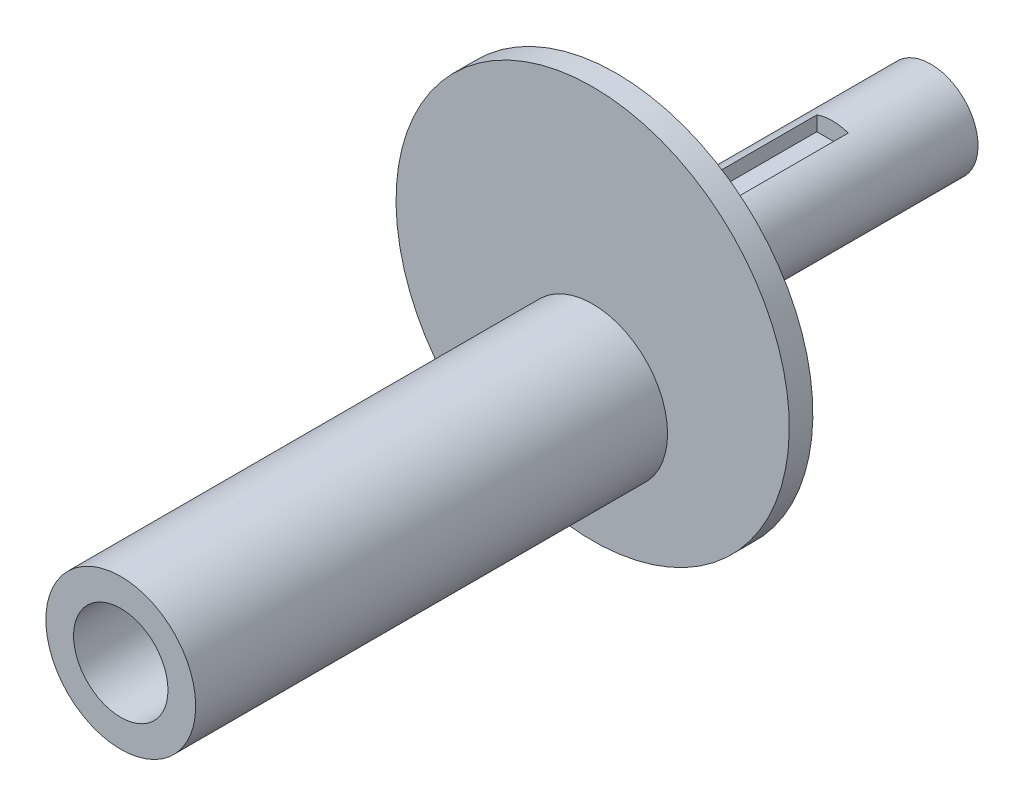
ISO-10303-21;
HEADER;
FILE_DESCRIPTION(('STEP AP214'),'2;1');
FILE_NAME('part.step','',(''),(''),'','','');
FILE_SCHEMA(('AUTOMOTIVE_DESIGN { 1 0 10303 214 1 1 1 1 }'));
ENDSEC;
DATA;
#1=APPLICATION_CONTEXT('core data for automotive mechanical design processes');
#2=APPLICATION_PROTOCOL_DEFINITION('international standard','automotive_design',2000,#1);
#3=PRODUCT_CONTEXT('',#1,'mechanical');
#4=PRODUCT('Part','Part','',(#3));
#5=PRODUCT_RELATED_PRODUCT_CATEGORY('part','',(#4));
#6=PRODUCT_DEFINITION_FORMATION('','',#4);
#7=PRODUCT_DEFINITION_CONTEXT('part definition',#1,'design');
#8=PRODUCT_DEFINITION('design','',#6,#7);
#9=PRODUCT_DEFINITION_SHAPE('','',#8);
#10=(LENGTH_UNIT() NAMED_UNIT(*) SI_UNIT(.MILLI.,.METRE.));
#11=(NAMED_UNIT(*) PLANE_ANGLE_UNIT() SI_UNIT($,.RADIAN.));
#12=(NAMED_UNIT(*) SI_UNIT($,.STERADIAN.) SOLID_ANGLE_UNIT());
#13=UNCERTAINTY_MEASURE_WITH_UNIT(LENGTH_MEASURE(1.E-05),#10,'distance_accuracy_value','');
#14=(GEOMETRIC_REPRESENTATION_CONTEXT(3) GLOBAL_UNCERTAINTY_ASSIGNED_CONTEXT((#13)) GLOBAL_UNIT_ASSIGNED_CONTEXT((#10,
#11,#12)) REPRESENTATION_CONTEXT('',''));
#15=CARTESIAN_POINT('',(0.,0.,0.));
#16=DIRECTION('',(0.,0.,1.));
#17=DIRECTION('',(1.,0.,0.));
#18=AXIS2_PLACEMENT_3D('',#15,#16,#17);
#19=CARTESIAN_POINT('',(0.,0.,-27.0900744143345));
#20=DIRECTION('',(0.,0.,-1.));
#21=DIRECTION('',(0.,1.,0.));
#22=AXIS2_PLACEMENT_3D('',#19,#20,#21);
#23=CYLINDRICAL_SURFACE('',#22,6.);
#24=CARTESIAN_POINT('',(0.,0.,0.));
#25=DIRECTION('',(0.,0.,-1.));
#26=DIRECTION('',(0.,1.,0.));
#27=AXIS2_PLACEMENT_3D('',#24,#25,#26);
#28=CIRCLE('',#27,6.00000000000001);
#29=CARTESIAN_POINT('',(0.,6.,0.));
#30=VERTEX_POINT('',#29);
#31=EDGE_CURVE('E169',#30,#30,#28,.T.);
#32=ORIENTED_EDGE('',*,*,#31,.T.);
#33=EDGE_LOOP('',(#32));
#34=FACE_BOUND('',#33,.T.);
#35=CARTESIAN_POINT('',(0.,0.,-40.));
#36=DIRECTION('',(0.,0.,-1.));
#37=DIRECTION('',(0.,1.,0.));
#38=AXIS2_PLACEMENT_3D('',#35,#36,#37);
#39=CIRCLE('',#38,6.);
#40=CARTESIAN_POINT('',(0.,6.,-40.));
#41=VERTEX_POINT('',#40);
#42=EDGE_CURVE('E166',#41,#41,#39,.T.);
#43=ORIENTED_EDGE('',*,*,#42,.F.);
#44=EDGE_LOOP('',(#43));
#45=FACE_BOUND('',#44,.T.);
#46=DIRECTION('',(0.,0.,-1.));
#47=VECTOR('',#46,1.);
#48=CARTESIAN_POINT('',(2.00000000000089,-5.65685424949207,-27.0900744143345));
#49=LINE('',#48,#47);
#50=CARTESIAN_POINT('',(2.00000000000089,-5.65685424949208,-2.5));
#51=VERTEX_POINT('',#50);
#52=CARTESIAN_POINT('',(2.00000000000089,-5.65685424949207,-27.5));
#53=VERTEX_POINT('',#52);
#54=EDGE_CURVE('E183',#51,#53,#49,.T.);
#55=ORIENTED_EDGE('',*,*,#54,.T.);
#56=CARTESIAN_POINT('',(0.,0.,-27.5));
#57=DIRECTION('',(0.,0.,1.));
#58=DIRECTION('',(1.,0.,0.));
#59=AXIS2_PLACEMENT_3D('',#56,#57,#58);
#60=CIRCLE('',#59,6.);
#61=CARTESIAN_POINT('',(-1.99999999999911,-5.6568542494927,-27.5));
#62=VERTEX_POINT('',#61);
#63=EDGE_CURVE('E189',#53,#62,#60,.F.);
#64=ORIENTED_EDGE('',*,*,#63,.T.);
#65=DIRECTION('',(0.,0.,-1.));
#66=VECTOR('',#65,1.);
#67=CARTESIAN_POINT('',(-1.99999999999911,-5.6568542494927,-27.0900744143345));
#68=LINE('',#67,#66);
#69=CARTESIAN_POINT('',(-1.99999999999911,-5.6568542494927,-2.5));
#70=VERTEX_POINT('',#69);
#71=EDGE_CURVE('E186',#62,#70,#68,.F.);
#72=ORIENTED_EDGE('',*,*,#71,.T.);
#73=CARTESIAN_POINT('',(0.,0.,-2.5));
#74=DIRECTION('',(0.,0.,1.));
#75=DIRECTION('',(1.,0.,0.));
#76=AXIS2_PLACEMENT_3D('',#73,#74,#75);
#77=CIRCLE('',#76,6.);
#78=EDGE_CURVE('E181',#51,#70,#77,.F.);
#79=ORIENTED_EDGE('',*,*,#78,.F.);
#80=EDGE_LOOP('',(#55,#64,#72,#79));
#81=FACE_BOUND('',#80,.T.);
#82=DIRECTION('',(0.,0.,-1.));
#83=VECTOR('',#82,1.);
#84=CARTESIAN_POINT('',(-1.99999999999911,5.6568542494927,-27.0900744143345));
#85=LINE('',#84,#83);
#86=CARTESIAN_POINT('',(-1.99999999999911,5.6568542494927,-27.5));
#87=VERTEX_POINT('',#86);
#88=CARTESIAN_POINT('',(-1.99999999999911,5.65685424949269,-2.5));
#89=VERTEX_POINT('',#88);
#90=EDGE_CURVE('E42',#87,#89,#85,.F.);
#91=ORIENTED_EDGE('',*,*,#90,.F.);
#92=CARTESIAN_POINT('',(0.,0.,-27.5));
#93=DIRECTION('',(0.,0.,1.));
#94=DIRECTION('',(1.,0.,0.));
#95=AXIS2_PLACEMENT_3D('',#92,#93,#94);
#96=CIRCLE('',#95,6.);
#97=CARTESIAN_POINT('',(2.00000000000089,5.65685424949207,-27.5));
#98=VERTEX_POINT('',#97);
#99=EDGE_CURVE('E11',#87,#98,#96,.F.);
#100=ORIENTED_EDGE('',*,*,#99,.T.);
#101=DIRECTION('',(0.,0.,-1.));
#102=VECTOR('',#101,1.);
#103=CARTESIAN_POINT('',(2.00000000000089,5.65685424949207,-27.0900744143345));
#104=LINE('',#103,#102);
#105=CARTESIAN_POINT('',(2.00000000000089,5.65685424949206,-2.5));
#106=VERTEX_POINT('',#105);
#107=EDGE_CURVE('E119',#106,#98,#104,.T.);
#108=ORIENTED_EDGE('',*,*,#107,.F.);
#109=CARTESIAN_POINT('',(0.,0.,-2.5));
#110=DIRECTION('',(0.,0.,1.));
#111=DIRECTION('',(1.,0.,0.));
#112=AXIS2_PLACEMENT_3D('',#109,#110,#111);
#113=CIRCLE('',#112,6.);
#114=EDGE_CURVE('E192',#89,#106,#113,.F.);
#115=ORIENTED_EDGE('',*,*,#114,.F.);
#116=EDGE_LOOP('',(#91,#100,#108,#115));
#117=FACE_BOUND('',#116,.T.);
#118=ADVANCED_FACE('F34',(#34,#45,#81,#117),#23,.T.);
#119=CARTESIAN_POINT('',(0.,0.,-27.0900744143345));
#120=DIRECTION('',(0.,0.,-1.));
#121=DIRECTION('',(0.,1.,0.));
#122=AXIS2_PLACEMENT_3D('',#119,#120,#121);
#123=CONICAL_SURFACE('',#122,0.,1.22173047639603);
#124=CARTESIAN_POINT('',(0.,0.,-28.));
#125=DIRECTION('',(0.,0.,-1.));
#126=DIRECTION('',(0.,1.,0.));
#127=AXIS2_PLACEMENT_3D('',#124,#125,#126);
#128=CIRCLE('',#127,2.5);
#129=CARTESIAN_POINT('',(0.,2.5,-28.));
#130=VERTEX_POINT('',#129);
#131=EDGE_CURVE('E158',#130,#130,#128,.T.);
#132=ORIENTED_EDGE('',*,*,#131,.T.);
#133=EDGE_LOOP('',(#132));
#134=FACE_BOUND('',#133,.T.);
#135=CARTESIAN_POINT('',(0.,0.,-27.0900744143345));
#136=VERTEX_POINT('',#135);
#137=VERTEX_LOOP('',#136);
#138=FACE_BOUND('',#137,.T.);
#139=ADVANCED_FACE('F36',(#134,#138),#123,.F.);
#140=CARTESIAN_POINT('',(0.,25.,3.00000000000001));
#141=DIRECTION('',(0.,0.,1.));
#142=DIRECTION('',(0.,-1.,0.));
#143=AXIS2_PLACEMENT_3D('',#140,#141,#142);
#144=PLANE('',#143);
#145=CARTESIAN_POINT('',(0.,-8.4375,3.));
#146=DIRECTION('',(0.,0.,1.));
#147=DIRECTION('',(1.,0.,0.));
#148=AXIS2_PLACEMENT_3D('',#145,#146,#147);
#149=CIRCLE('',#148,9.525);
#150=CARTESIAN_POINT('',(9.525,-8.4375,3.));
#151=VERTEX_POINT('',#150);
#152=EDGE_CURVE('E154',#151,#151,#149,.T.);
#153=ORIENTED_EDGE('',*,*,#152,.F.);
#154=EDGE_LOOP('',(#153));
#155=FACE_BOUND('',#154,.T.);
#156=CARTESIAN_POINT('',(0.,0.,3.));
#157=DIRECTION('',(0.,0.,-1.));
#158=DIRECTION('',(0.,1.,0.));
#159=AXIS2_PLACEMENT_3D('',#156,#157,#158);
#160=CIRCLE('',#159,25.);
#161=CARTESIAN_POINT('',(0.,25.,3.));
#162=VERTEX_POINT('',#161);
#163=EDGE_CURVE('E175',#162,#162,#160,.T.);
#164=ORIENTED_EDGE('',*,*,#163,.F.);
#165=EDGE_LOOP('',(#164));
#166=FACE_BOUND('',#165,.T.);
#167=ADVANCED_FACE('F213',(#155,#166),#144,.T.);
#168=CARTESIAN_POINT('',(0.,0.,-27.0900744143345));
#169=DIRECTION('',(0.,0.,-1.));
#170=DIRECTION('',(0.,1.,0.));
#171=AXIS2_PLACEMENT_3D('',#168,#169,#170);
#172=CYLINDRICAL_SURFACE('',#171,25.);
#173=ORIENTED_EDGE('',*,*,#163,.T.);
#174=EDGE_LOOP('',(#173));
#175=FACE_BOUND('',#174,.T.);
#176=CARTESIAN_POINT('',(0.,0.,0.));
#177=DIRECTION('',(0.,0.,-1.));
#178=DIRECTION('',(0.,1.,0.));
#179=AXIS2_PLACEMENT_3D('',#176,#177,#178);
#180=CIRCLE('',#179,25.);
#181=CARTESIAN_POINT('',(0.,25.,0.));
#182=VERTEX_POINT('',#181);
#183=EDGE_CURVE('E172',#182,#182,#180,.T.);
#184=ORIENTED_EDGE('',*,*,#183,.F.);
#185=EDGE_LOOP('',(#184));
#186=FACE_BOUND('',#185,.T.);
#187=ADVANCED_FACE('F223',(#175,#186),#172,.T.);
#188=CARTESIAN_POINT('',(0.,6.,0.));
#189=DIRECTION('',(0.,0.,-1.));
#190=DIRECTION('',(0.,1.,0.));
#191=AXIS2_PLACEMENT_3D('',#188,#189,#190);
#192=PLANE('',#191);
#193=ORIENTED_EDGE('',*,*,#183,.T.);
#194=EDGE_LOOP('',(#193));
#195=FACE_BOUND('',#194,.T.);
#196=ORIENTED_EDGE('',*,*,#31,.F.);
#197=EDGE_LOOP('',(#196));
#198=FACE_BOUND('',#197,.T.);
#199=ADVANCED_FACE('F220',(#195,#198),#192,.T.);
#200=CARTESIAN_POINT('',(0.,6.,-40.));
#201=DIRECTION('',(0.,0.,-1.));
#202=DIRECTION('',(0.,1.,0.));
#203=AXIS2_PLACEMENT_3D('',#200,#201,#202);
#204=PLANE('',#203);
#205=ORIENTED_EDGE('',*,*,#42,.T.);
#206=EDGE_LOOP('',(#205));
#207=FACE_BOUND('',#206,.T.);
#208=CARTESIAN_POINT('',(0.,0.,-40.));
#209=DIRECTION('',(0.,0.,-1.));
#210=DIRECTION('',(0.,1.,0.));
#211=AXIS2_PLACEMENT_3D('',#208,#209,#210);
#212=CIRCLE('',#211,2.5);
#213=CARTESIAN_POINT('',(0.,2.5,-40.));
#214=VERTEX_POINT('',#213);
#215=EDGE_CURVE('E163',#214,#214,#212,.T.);
#216=ORIENTED_EDGE('',*,*,#215,.F.);
#217=EDGE_LOOP('',(#216));
#218=FACE_BOUND('',#217,.T.);
#219=ADVANCED_FACE('F218',(#207,#218),#204,.T.);
#220=CARTESIAN_POINT('',(0.,0.,-27.0900744143345));
#221=DIRECTION('',(0.,0.,-1.));
#222=DIRECTION('',(0.,1.,0.));
#223=AXIS2_PLACEMENT_3D('',#220,#221,#222);
#224=CYLINDRICAL_SURFACE('',#223,2.5);
#225=ORIENTED_EDGE('',*,*,#215,.T.);
#226=EDGE_LOOP('',(#225));
#227=FACE_BOUND('',#226,.T.);
#228=ORIENTED_EDGE('',*,*,#131,.F.);
#229=EDGE_LOOP('',(#228));
#230=FACE_BOUND('',#229,.T.);
#231=ADVANCED_FACE('F259',(#227,#230),#224,.F.);
#232=CARTESIAN_POINT('',(0.,-8.4375,63.));
#233=DIRECTION('',(0.,0.,1.));
#234=DIRECTION('',(1.,0.,0.));
#235=AXIS2_PLACEMENT_3D('',#232,#233,#234);
#236=PLANE('',#235);
#237=CARTESIAN_POINT('',(0.,-8.4375,63.));
#238=DIRECTION('',(0.,0.,1.));
#239=DIRECTION('',(1.,0.,0.));
#240=AXIS2_PLACEMENT_3D('',#237,#238,#239);
#241=CIRCLE('',#240,9.525);
#242=CARTESIAN_POINT('',(9.525,-8.4375,63.));
#243=VERTEX_POINT('',#242);
#244=EDGE_CURVE('E155',#243,#243,#241,.T.);
#245=ORIENTED_EDGE('',*,*,#244,.T.);
#246=EDGE_LOOP('',(#245));
#247=FACE_BOUND('',#246,.T.);
#248=CARTESIAN_POINT('',(0.,-8.4375,63.));
#249=DIRECTION('',(0.,0.,1.));
#250=DIRECTION('',(1.,0.,0.));
#251=AXIS2_PLACEMENT_3D('',#248,#249,#250);
#252=CIRCLE('',#251,6.);
#253=CARTESIAN_POINT('',(6.,-8.4375,63.));
#254=VERTEX_POINT('',#253);
#255=EDGE_CURVE('E151',#254,#254,#252,.T.);
#256=ORIENTED_EDGE('',*,*,#255,.F.);
#257=EDGE_LOOP('',(#256));
#258=FACE_BOUND('',#257,.T.);
#259=ADVANCED_FACE('F253',(#247,#258),#236,.T.);
#260=CARTESIAN_POINT('',(0.,-8.4375,63.));
#261=DIRECTION('',(0.,0.,-1.));
#262=DIRECTION('',(-1.,0.,0.));
#263=AXIS2_PLACEMENT_3D('',#260,#261,#262);
#264=CYLINDRICAL_SURFACE('',#263,9.525);
#265=ORIENTED_EDGE('',*,*,#244,.F.);
#266=EDGE_LOOP('',(#265));
#267=FACE_BOUND('',#266,.T.);
#268=ORIENTED_EDGE('',*,*,#152,.T.);
#269=EDGE_LOOP('',(#268));
#270=FACE_BOUND('',#269,.T.);
#271=ADVANCED_FACE('F245',(#267,#270),#264,.T.);
#272=CARTESIAN_POINT('',(0.,-8.4375,63.));
#273=DIRECTION('',(0.,0.,-1.));
#274=DIRECTION('',(-1.,0.,0.));
#275=AXIS2_PLACEMENT_3D('',#272,#273,#274);
#276=CYLINDRICAL_SURFACE('',#275,6.);
#277=ORIENTED_EDGE('',*,*,#255,.T.);
#278=EDGE_LOOP('',(#277));
#279=FACE_BOUND('',#278,.T.);
#280=CARTESIAN_POINT('',(0.,-8.4375,3.));
#281=DIRECTION('',(0.,0.,1.));
#282=DIRECTION('',(0.,-1.,0.));
#283=AXIS2_PLACEMENT_3D('',#280,#281,#282);
#284=CIRCLE('',#283,6.);
#285=CARTESIAN_POINT('',(0.,-14.4375,2.99999999999999));
#286=VERTEX_POINT('',#285);
#287=EDGE_CURVE('E178',#286,#286,#284,.F.);
#288=ORIENTED_EDGE('',*,*,#287,.T.);
#289=EDGE_LOOP('',(#288));
#290=FACE_BOUND('',#289,.T.);
#291=ADVANCED_FACE('F236',(#279,#290),#276,.F.);
#292=ORIENTED_EDGE('',*,*,#287,.F.);
#293=EDGE_LOOP('',(#292));
#294=FACE_BOUND('',#293,.T.);
#295=ADVANCED_FACE('F229',(#294),#144,.T.);
#296=CARTESIAN_POINT('',(-1.99999999999911,-3.80000000000136,-27.5));
#297=DIRECTION('',(1.,0.,0.));
#298=DIRECTION('',(0.,1.,0.));
#299=AXIS2_PLACEMENT_3D('',#296,#297,#298);
#300=PLANE('',#299);
#301=DIRECTION('',(0.,1.,0.));
#302=VECTOR('',#301,1.);
#303=CARTESIAN_POINT('',(-1.99999999999911,-3.80000000000136,-27.5));
#304=LINE('',#303,#302);
#305=CARTESIAN_POINT('',(-1.99999999999911,-3.80000000000136,-27.5));
#306=VERTEX_POINT('',#305);
#307=EDGE_CURVE('E134',#62,#306,#304,.T.);
#308=ORIENTED_EDGE('',*,*,#307,.T.);
#309=DIRECTION('',(0.,0.,1.));
#310=VECTOR('',#309,1.);
#311=CARTESIAN_POINT('',(-1.99999999999911,-3.80000000000136,-27.5));
#312=LINE('',#311,#310);
#313=CARTESIAN_POINT('',(-1.99999999999911,-3.80000000000136,-2.5));
#314=VERTEX_POINT('',#313);
#315=EDGE_CURVE('E148',#306,#314,#312,.T.);
#316=ORIENTED_EDGE('',*,*,#315,.T.);
#317=DIRECTION('',(0.,1.,0.));
#318=VECTOR('',#317,1.);
#319=CARTESIAN_POINT('',(-1.99999999999911,-3.80000000000136,-2.5));
#320=LINE('',#319,#318);
#321=EDGE_CURVE('E112',#70,#314,#320,.T.);
#322=ORIENTED_EDGE('',*,*,#321,.F.);
#323=ORIENTED_EDGE('',*,*,#71,.F.);
#324=EDGE_LOOP('',(#308,#316,#322,#323));
#325=FACE_BOUND('',#324,.T.);
#326=ADVANCED_FACE('F235',(#325),#300,.T.);
#327=CARTESIAN_POINT('',(2.00000000000089,-3.80000000000136,-27.5));
#328=DIRECTION('',(0.,-1.,0.));
#329=DIRECTION('',(1.,0.,0.));
#330=AXIS2_PLACEMENT_3D('',#327,#328,#329);
#331=PLANE('',#330);
#332=DIRECTION('',(1.,0.,0.));
#333=VECTOR('',#332,1.);
#334=CARTESIAN_POINT('',(2.00000000000089,-3.80000000000136,-2.5));
#335=LINE('',#334,#333);
#336=CARTESIAN_POINT('',(2.00000000000089,-3.80000000000136,-2.5));
#337=VERTEX_POINT('',#336);
#338=EDGE_CURVE('E143',#314,#337,#335,.T.);
#339=ORIENTED_EDGE('',*,*,#338,.F.);
#340=ORIENTED_EDGE('',*,*,#315,.F.);
#341=DIRECTION('',(1.,0.,0.));
#342=VECTOR('',#341,1.);
#343=CARTESIAN_POINT('',(2.00000000000089,-3.80000000000136,-27.5));
#344=LINE('',#343,#342);
#345=CARTESIAN_POINT('',(2.00000000000089,-3.80000000000136,-27.5));
#346=VERTEX_POINT('',#345);
#347=EDGE_CURVE('E136',#306,#346,#344,.T.);
#348=ORIENTED_EDGE('',*,*,#347,.T.);
#349=DIRECTION('',(0.,0.,1.));
#350=VECTOR('',#349,1.);
#351=CARTESIAN_POINT('',(2.00000000000089,-3.80000000000136,-27.5));
#352=LINE('',#351,#350);
#353=EDGE_CURVE('E141',#346,#337,#352,.T.);
#354=ORIENTED_EDGE('',*,*,#353,.T.);
#355=EDGE_LOOP('',(#339,#340,#348,#354));
#356=FACE_BOUND('',#355,.T.);
#357=ADVANCED_FACE('F242',(#356),#331,.T.);
#358=CARTESIAN_POINT('',(2.00000000000089,-7.80000000000136,-27.5));
#359=DIRECTION('',(-1.,0.,0.));
#360=DIRECTION('',(0.,0.,1.));
#361=AXIS2_PLACEMENT_3D('',#358,#359,#360);
#362=PLANE('',#361);
#363=DIRECTION('',(0.,-1.,0.));
#364=VECTOR('',#363,1.);
#365=CARTESIAN_POINT('',(2.00000000000089,-7.80000000000136,-2.5));
#366=LINE('',#365,#364);
#367=EDGE_CURVE('E57',#337,#51,#366,.T.);
#368=ORIENTED_EDGE('',*,*,#367,.F.);
#369=ORIENTED_EDGE('',*,*,#353,.F.);
#370=DIRECTION('',(0.,-1.,0.));
#371=VECTOR('',#370,1.);
#372=CARTESIAN_POINT('',(2.00000000000089,-7.80000000000136,-27.5));
#373=LINE('',#372,#371);
#374=EDGE_CURVE('E138',#346,#53,#373,.T.);
#375=ORIENTED_EDGE('',*,*,#374,.T.);
#376=ORIENTED_EDGE('',*,*,#54,.F.);
#377=EDGE_LOOP('',(#368,#369,#375,#376));
#378=FACE_BOUND('',#377,.T.);
#379=ADVANCED_FACE('F278',(#378),#362,.T.);
#380=CARTESIAN_POINT('',(0.,0.,-27.5));
#381=DIRECTION('',(0.,0.,1.));
#382=DIRECTION('',(1.,0.,0.));
#383=AXIS2_PLACEMENT_3D('',#380,#381,#382);
#384=PLANE('',#383);
#385=ORIENTED_EDGE('',*,*,#374,.F.);
#386=ORIENTED_EDGE('',*,*,#347,.F.);
#387=ORIENTED_EDGE('',*,*,#307,.F.);
#388=ORIENTED_EDGE('',*,*,#63,.F.);
#389=EDGE_LOOP('',(#385,#386,#387,#388));
#390=FACE_BOUND('',#389,.T.);
#391=ADVANCED_FACE('F283',(#390),#384,.T.);
#392=CARTESIAN_POINT('',(0.,0.,-2.5));
#393=DIRECTION('',(0.,0.,1.));
#394=DIRECTION('',(1.,0.,0.));
#395=AXIS2_PLACEMENT_3D('',#392,#393,#394);
#396=PLANE('',#395);
#397=ORIENTED_EDGE('',*,*,#78,.T.);
#398=ORIENTED_EDGE('',*,*,#321,.T.);
#399=ORIENTED_EDGE('',*,*,#338,.T.);
#400=ORIENTED_EDGE('',*,*,#367,.T.);
#401=EDGE_LOOP('',(#397,#398,#399,#400));
#402=FACE_BOUND('',#401,.T.);
#403=ADVANCED_FACE('F288',(#402),#396,.F.);
#404=CARTESIAN_POINT('',(-1.99999999999911,3.80000000000136,-27.5));
#405=DIRECTION('',(-1.,0.,0.));
#406=DIRECTION('',(0.,-1.,0.));
#407=AXIS2_PLACEMENT_3D('',#404,#405,#406);
#408=PLANE('',#407);
#409=ORIENTED_EDGE('',*,*,#90,.T.);
#410=DIRECTION('',(0.,-1.,0.));
#411=VECTOR('',#410,1.);
#412=CARTESIAN_POINT('',(-1.99999999999911,3.80000000000136,-2.5));
#413=LINE('',#412,#411);
#414=CARTESIAN_POINT('',(-1.99999999999911,3.80000000000136,-2.5));
#415=VERTEX_POINT('',#414);
#416=EDGE_CURVE('E49',#89,#415,#413,.T.);
#417=ORIENTED_EDGE('',*,*,#416,.T.);
#418=DIRECTION('',(0.,0.,1.));
#419=VECTOR('',#418,1.);
#420=CARTESIAN_POINT('',(-1.99999999999911,3.80000000000136,-27.5));
#421=LINE('',#420,#419);
#422=CARTESIAN_POINT('',(-1.99999999999911,3.80000000000136,-27.5));
#423=VERTEX_POINT('',#422);
#424=EDGE_CURVE('E113',#423,#415,#421,.T.);
#425=ORIENTED_EDGE('',*,*,#424,.F.);
#426=DIRECTION('',(0.,-1.,0.));
#427=VECTOR('',#426,1.);
#428=CARTESIAN_POINT('',(-1.99999999999911,3.80000000000136,-27.5));
#429=LINE('',#428,#427);
#430=EDGE_CURVE('E121',#87,#423,#429,.T.);
#431=ORIENTED_EDGE('',*,*,#430,.F.);
#432=EDGE_LOOP('',(#409,#417,#425,#431));
#433=FACE_BOUND('',#432,.T.);
#434=ADVANCED_FACE('F197',(#433),#408,.F.);
#435=CARTESIAN_POINT('',(2.00000000000089,7.80000000000136,-27.5));
#436=DIRECTION('',(1.,0.,0.));
#437=DIRECTION('',(0.,0.,-1.));
#438=AXIS2_PLACEMENT_3D('',#435,#436,#437);
#439=PLANE('',#438);
#440=ORIENTED_EDGE('',*,*,#107,.T.);
#441=DIRECTION('',(0.,1.,0.));
#442=VECTOR('',#441,1.);
#443=CARTESIAN_POINT('',(2.00000000000089,7.80000000000136,-27.5));
#444=LINE('',#443,#442);
#445=CARTESIAN_POINT('',(2.00000000000089,3.80000000000136,-27.5));
#446=VERTEX_POINT('',#445);
#447=EDGE_CURVE('E116',#446,#98,#444,.T.);
#448=ORIENTED_EDGE('',*,*,#447,.F.);
#449=DIRECTION('',(0.,0.,1.));
#450=VECTOR('',#449,1.);
#451=CARTESIAN_POINT('',(2.00000000000089,3.80000000000136,-27.5));
#452=LINE('',#451,#450);
#453=CARTESIAN_POINT('',(2.00000000000089,3.80000000000136,-2.5));
#454=VERTEX_POINT('',#453);
#455=EDGE_CURVE('E102',#446,#454,#452,.T.);
#456=ORIENTED_EDGE('',*,*,#455,.T.);
#457=DIRECTION('',(0.,1.,0.));
#458=VECTOR('',#457,1.);
#459=CARTESIAN_POINT('',(2.00000000000089,7.80000000000136,-2.5));
#460=LINE('',#459,#458);
#461=EDGE_CURVE('E131',#454,#106,#460,.T.);
#462=ORIENTED_EDGE('',*,*,#461,.T.);
#463=EDGE_LOOP('',(#440,#448,#456,#462));
#464=FACE_BOUND('',#463,.T.);
#465=ADVANCED_FACE('F117',(#464),#439,.F.);
#466=CARTESIAN_POINT('',(2.00000000000089,3.80000000000136,-27.5));
#467=DIRECTION('',(0.,-1.,0.));
#468=DIRECTION('',(1.,0.,0.));
#469=AXIS2_PLACEMENT_3D('',#466,#467,#468);
#470=PLANE('',#469);
#471=DIRECTION('',(1.,0.,0.));
#472=VECTOR('',#471,1.);
#473=CARTESIAN_POINT('',(2.00000000000089,3.80000000000136,-2.5));
#474=LINE('',#473,#472);
#475=EDGE_CURVE('E108',#415,#454,#474,.T.);
#476=ORIENTED_EDGE('',*,*,#475,.T.);
#477=ORIENTED_EDGE('',*,*,#455,.F.);
#478=DIRECTION('',(1.,0.,0.));
#479=VECTOR('',#478,1.);
#480=CARTESIAN_POINT('',(2.00000000000089,3.80000000000136,-27.5));
#481=LINE('',#480,#479);
#482=EDGE_CURVE('E107',#423,#446,#481,.T.);
#483=ORIENTED_EDGE('',*,*,#482,.F.);
#484=ORIENTED_EDGE('',*,*,#424,.T.);
#485=EDGE_LOOP('',(#476,#477,#483,#484));
#486=FACE_BOUND('',#485,.T.);
#487=ADVANCED_FACE('F104',(#486),#470,.F.);
#488=CARTESIAN_POINT('',(0.,0.,-27.5));
#489=DIRECTION('',(0.,0.,1.));
#490=DIRECTION('',(1.,0.,0.));
#491=AXIS2_PLACEMENT_3D('',#488,#489,#490);
#492=PLANE('',#491);
#493=ORIENTED_EDGE('',*,*,#430,.T.);
#494=ORIENTED_EDGE('',*,*,#482,.T.);
#495=ORIENTED_EDGE('',*,*,#447,.T.);
#496=ORIENTED_EDGE('',*,*,#99,.F.);
#497=EDGE_LOOP('',(#493,#494,#495,#496));
#498=FACE_BOUND('',#497,.T.);
#499=ADVANCED_FACE('F123',(#498),#492,.T.);
#500=CARTESIAN_POINT('',(0.,0.,-2.5));
#501=DIRECTION('',(0.,0.,1.));
#502=DIRECTION('',(1.,0.,0.));
#503=AXIS2_PLACEMENT_3D('',#500,#501,#502);
#504=PLANE('',#503);
#505=ORIENTED_EDGE('',*,*,#114,.T.);
#506=ORIENTED_EDGE('',*,*,#461,.F.);
#507=ORIENTED_EDGE('',*,*,#475,.F.);
#508=ORIENTED_EDGE('',*,*,#416,.F.);
#509=EDGE_LOOP('',(#505,#506,#507,#508));
#510=FACE_BOUND('',#509,.T.);
#511=ADVANCED_FACE('F199',(#510),#504,.F.);
#512=CLOSED_SHELL('',(#118,#139,#167,#187,#199,#219,#231,#259,#271,#291,#295,#326,#357,#379,
#391,#403,#434,#465,#487,#499,#511));
#513=MANIFOLD_SOLID_BREP('B2',#512);
#514=ADVANCED_BREP_SHAPE_REPRESENTATION('',(#18,#513),#14);
#515=SHAPE_DEFINITION_REPRESENTATION(#9,#514);
ENDSEC;
END-ISO-10303-21;
